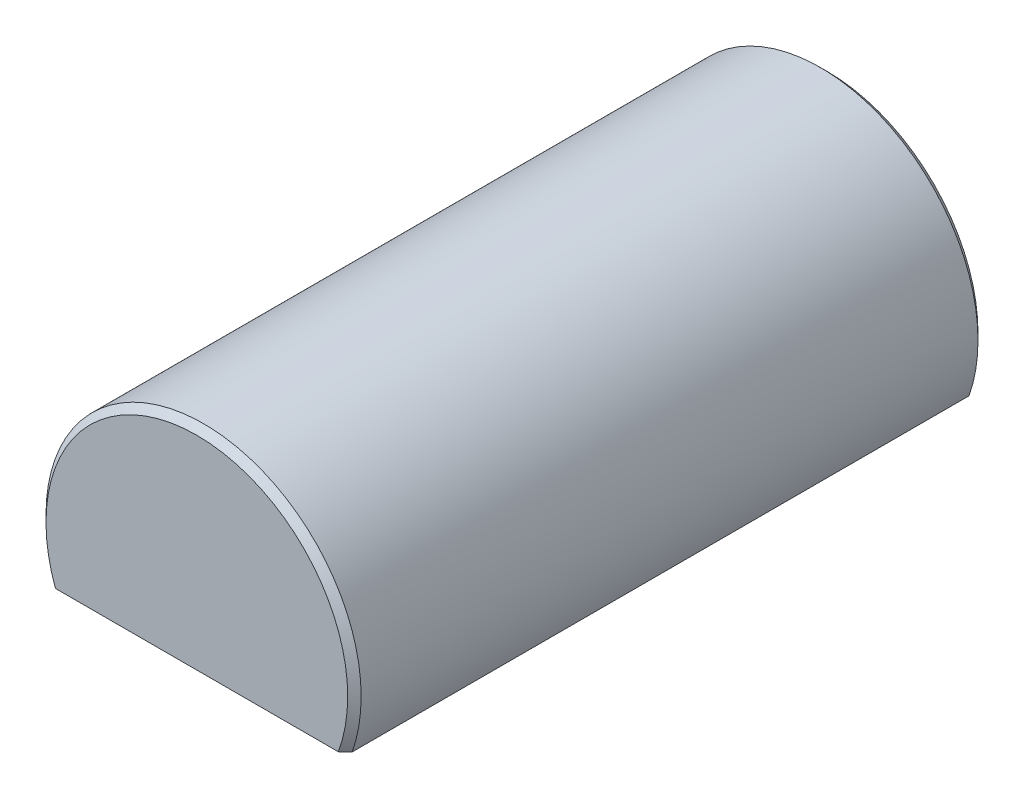
ISO-10303-21;
HEADER;
FILE_DESCRIPTION(('STEP AP214'),'2;1');
FILE_NAME('part.step','',(''),(''),'','','');
FILE_SCHEMA(('AUTOMOTIVE_DESIGN { 1 0 10303 214 1 1 1 1 }'));
ENDSEC;
DATA;
#1=APPLICATION_CONTEXT('core data for automotive mechanical design processes');
#2=APPLICATION_PROTOCOL_DEFINITION('international standard','automotive_design',2000,#1);
#3=PRODUCT_CONTEXT('',#1,'mechanical');
#4=PRODUCT('Part','Part','',(#3));
#5=PRODUCT_RELATED_PRODUCT_CATEGORY('part','',(#4));
#6=PRODUCT_DEFINITION_FORMATION('','',#4);
#7=PRODUCT_DEFINITION_CONTEXT('part definition',#1,'design');
#8=PRODUCT_DEFINITION('design','',#6,#7);
#9=PRODUCT_DEFINITION_SHAPE('','',#8);
#10=(LENGTH_UNIT() NAMED_UNIT(*) SI_UNIT(.MILLI.,.METRE.));
#11=(NAMED_UNIT(*) PLANE_ANGLE_UNIT() SI_UNIT($,.RADIAN.));
#12=(NAMED_UNIT(*) SI_UNIT($,.STERADIAN.) SOLID_ANGLE_UNIT());
#13=UNCERTAINTY_MEASURE_WITH_UNIT(LENGTH_MEASURE(1.E-05),#10,'distance_accuracy_value','');
#14=(GEOMETRIC_REPRESENTATION_CONTEXT(3) GLOBAL_UNCERTAINTY_ASSIGNED_CONTEXT((#13)) GLOBAL_UNIT_ASSIGNED_CONTEXT((#10,
#11,#12)) REPRESENTATION_CONTEXT('',''));
#15=CARTESIAN_POINT('',(0.,0.,0.));
#16=DIRECTION('',(0.,0.,1.));
#17=DIRECTION('',(1.,0.,0.));
#18=AXIS2_PLACEMENT_3D('',#15,#16,#17);
#19=CARTESIAN_POINT('',(0.,0.,19.05));
#20=DIRECTION('',(0.,0.,-1.));
#21=DIRECTION('',(-1.,0.,0.));
#22=AXIS2_PLACEMENT_3D('',#19,#20,#21);
#23=CYLINDRICAL_SURFACE('',#22,9.525);
#24=CARTESIAN_POINT('',(0.,0.,18.6436));
#25=DIRECTION('',(0.,0.,1.));
#26=DIRECTION('',(1.,0.,0.));
#27=AXIS2_PLACEMENT_3D('',#24,#25,#26);
#28=CIRCLE('',#27,9.525);
#29=CARTESIAN_POINT('',(-8.98025612106915,-3.175,18.6436));
#30=VERTEX_POINT('',#29);
#31=CARTESIAN_POINT('',(8.98025612106915,-3.175,18.6436));
#32=VERTEX_POINT('',#31);
#33=EDGE_CURVE('E223',#30,#32,#28,.F.);
#34=ORIENTED_EDGE('',*,*,#33,.T.);
#35=DIRECTION('',(0.,0.,1.));
#36=VECTOR('',#35,1.);
#37=CARTESIAN_POINT('',(8.98025612106915,-3.175,-19.05));
#38=LINE('',#37,#36);
#39=CARTESIAN_POINT('',(8.98025612106915,-3.175,-18.6436));
#40=VERTEX_POINT('',#39);
#41=EDGE_CURVE('E210',#40,#32,#38,.T.);
#42=ORIENTED_EDGE('',*,*,#41,.F.);
#43=CARTESIAN_POINT('',(0.,0.,-18.6436));
#44=DIRECTION('',(0.,0.,1.));
#45=DIRECTION('',(1.,0.,0.));
#46=AXIS2_PLACEMENT_3D('',#43,#44,#45);
#47=CIRCLE('',#46,9.525);
#48=CARTESIAN_POINT('',(-8.98025612106915,-3.175,-18.6436));
#49=VERTEX_POINT('',#48);
#50=EDGE_CURVE('E307',#40,#49,#47,.T.);
#51=ORIENTED_EDGE('',*,*,#50,.T.);
#52=DIRECTION('',(0.,0.,1.));
#53=VECTOR('',#52,1.);
#54=CARTESIAN_POINT('',(-8.98025612106915,-3.175,-19.05));
#55=LINE('',#54,#53);
#56=EDGE_CURVE('E211',#49,#30,#55,.T.);
#57=ORIENTED_EDGE('',*,*,#56,.T.);
#58=EDGE_LOOP('',(#34,#42,#51,#57));
#59=FACE_BOUND('',#58,.T.);
#60=ADVANCED_FACE('F46',(#59),#23,.T.);
#61=CARTESIAN_POINT('',(0.,0.,19.05));
#62=DIRECTION('',(0.,0.,1.));
#63=DIRECTION('',(1.,0.,0.));
#64=AXIS2_PLACEMENT_3D('',#61,#62,#63);
#65=PLANE('',#64);
#66=DIRECTION('',(-1.,0.,0.));
#67=VECTOR('',#66,1.);
#68=CARTESIAN_POINT('',(-8.98025612106915,-3.175,19.05));
#69=LINE('',#68,#67);
#70=CARTESIAN_POINT('',(8.54799631258697,-3.175,19.05));
#71=VERTEX_POINT('',#70);
#72=CARTESIAN_POINT('',(-8.54799631258697,-3.175,19.05));
#73=VERTEX_POINT('',#72);
#74=EDGE_CURVE('E68',#71,#73,#69,.T.);
#75=ORIENTED_EDGE('',*,*,#74,.F.);
#76=CARTESIAN_POINT('',(0.,0.,19.05));
#77=DIRECTION('',(0.,0.,1.));
#78=DIRECTION('',(1.,0.,0.));
#79=AXIS2_PLACEMENT_3D('',#76,#77,#78);
#80=CIRCLE('',#79,9.11860000000002);
#81=EDGE_CURVE('E245',#71,#73,#80,.T.);
#82=ORIENTED_EDGE('',*,*,#81,.T.);
#83=EDGE_LOOP('',(#75,#82));
#84=FACE_BOUND('',#83,.T.);
#85=ADVANCED_FACE('F293',(#84),#65,.T.);
#86=CARTESIAN_POINT('',(0.,0.,-19.05));
#87=DIRECTION('',(0.,0.,1.));
#88=DIRECTION('',(1.,0.,0.));
#89=AXIS2_PLACEMENT_3D('',#86,#87,#88);
#90=PLANE('',#89);
#91=CARTESIAN_POINT('',(0.,0.,-19.05));
#92=DIRECTION('',(0.,0.,1.));
#93=DIRECTION('',(1.,0.,0.));
#94=AXIS2_PLACEMENT_3D('',#91,#92,#93);
#95=CIRCLE('',#94,9.11859999999996);
#96=CARTESIAN_POINT('',(-8.54799631258691,-3.175,-19.05));
#97=VERTEX_POINT('',#96);
#98=CARTESIAN_POINT('',(8.54799631258691,-3.175,-19.05));
#99=VERTEX_POINT('',#98);
#100=EDGE_CURVE('E308',#97,#99,#95,.F.);
#101=ORIENTED_EDGE('',*,*,#100,.T.);
#102=DIRECTION('',(-1.,0.,0.));
#103=VECTOR('',#102,1.);
#104=CARTESIAN_POINT('',(-8.98025612106915,-3.175,-19.05));
#105=LINE('',#104,#103);
#106=EDGE_CURVE('E207',#99,#97,#105,.T.);
#107=ORIENTED_EDGE('',*,*,#106,.T.);
#108=EDGE_LOOP('',(#101,#107));
#109=FACE_BOUND('',#108,.T.);
#110=ADVANCED_FACE('F298',(#109),#90,.F.);
#111=CARTESIAN_POINT('',(0.,0.,-18.6436));
#112=DIRECTION('',(0.,0.,1.));
#113=DIRECTION('',(1.,0.,0.));
#114=AXIS2_PLACEMENT_3D('',#111,#112,#113);
#115=CONICAL_SURFACE('',#114,9.525,0.785398163397444);
#116=CARTESIAN_POINT('',(-19.7595218480049,-3.175,-8.15562099481972));
#117=CARTESIAN_POINT('',(-19.1925140216925,-3.175,-8.71541833970159));
#118=CARTESIAN_POINT('',(-18.6252305331766,-3.175,-9.2749372301075));
#119=CARTESIAN_POINT('',(-17.4894657452954,-3.175,-10.3935596725078));
#120=CARTESIAN_POINT('',(-16.9209838832793,-3.175,-10.9526626531449));
#121=CARTESIAN_POINT('',(-15.7755741167121,-3.175,-12.0770696474654));
#122=CARTESIAN_POINT('',(-15.1986325304486,-3.175,-12.6423597290652));
#123=CARTESIAN_POINT('',(-14.0436688072204,-3.175,-13.7710255464828));
#124=CARTESIAN_POINT('',(-13.4656477108255,-3.175,-14.3344023462318));
#125=CARTESIAN_POINT('',(-12.4705159540613,-3.175,-15.3006344002602));
#126=CARTESIAN_POINT('',(-12.053923381691,-3.175,-15.7040230509635));
#127=CARTESIAN_POINT('',(-11.2192222208861,-3.175,-16.5092923897319));
#128=CARTESIAN_POINT('',(-10.801113522204,-3.175,-16.9111729636285));
#129=CARTESIAN_POINT('',(-9.96180438900596,-3.175,-17.7137894720875));
#130=CARTESIAN_POINT('',(-9.54059885127731,-3.175,-18.1145200738019));
#131=CARTESIAN_POINT('',(-8.69536369274989,-3.175,-18.9127645983045));
#132=CARTESIAN_POINT('',(-8.27133489125377,-3.175,-19.3102793859794));
#133=CARTESIAN_POINT('',(-7.63417072982144,-3.175,-19.9008908184188));
#134=CARTESIAN_POINT('',(-7.42271751985768,-3.175,-20.0958012630927));
#135=CARTESIAN_POINT('',(-6.99843064471583,-3.175,-20.484114250534));
#136=CARTESIAN_POINT('',(-6.78559698276185,-3.175,-20.6775167968208));
#137=CARTESIAN_POINT('',(-6.35793966377379,-3.175,-21.0625925503336));
#138=CARTESIAN_POINT('',(-6.1431140635317,-3.175,-21.254263604613));
#139=CARTESIAN_POINT('',(-5.81916935713244,-3.175,-21.5398164840543));
#140=CARTESIAN_POINT('',(-5.71090790489853,-3.175,-21.63467128779));
#141=CARTESIAN_POINT('',(-5.49371873101143,-3.175,-21.8236251078582));
#142=CARTESIAN_POINT('',(-5.38479097918381,-3.175,-21.9177240895089));
#143=CARTESIAN_POINT('',(-5.05787462655518,-3.175,-22.197831488485));
#144=CARTESIAN_POINT('',(-4.83875951405758,-3.175,-22.3825297757046));
#145=CARTESIAN_POINT('',(-4.39646847568306,-3.175,-22.7469971377807));
#146=CARTESIAN_POINT('',(-4.17329291837066,-3.175,-22.9267666563421));
#147=CARTESIAN_POINT('',(-3.834437030073,-3.175,-23.1907907398475));
#148=CARTESIAN_POINT('',(-3.72089777113939,-3.175,-23.2777913468337));
#149=CARTESIAN_POINT('',(-3.49211368943674,-3.175,-23.4495161287082));
#150=CARTESIAN_POINT('',(-3.37686895479634,-3.175,-23.5342404205902));
#151=CARTESIAN_POINT('',(-3.14439364175474,-3.175,-23.7007968775851));
#152=CARTESIAN_POINT('',(-3.02716412294898,-3.175,-23.7826305180934));
#153=CARTESIAN_POINT('',(-2.79025811492876,-3.175,-23.9426648438419));
#154=CARTESIAN_POINT('',(-2.67058203505147,-3.175,-24.0208661297667));
#155=CARTESIAN_POINT('',(-2.52052463750115,-3.175,-24.1148160231544));
#156=CARTESIAN_POINT('',(-2.49152725675283,-3.175,-24.1327846392309));
#157=CARTESIAN_POINT('',(-2.43335482916832,-3.175,-24.1684360452421));
#158=CARTESIAN_POINT('',(-2.40417977182546,-3.175,-24.1861188180433));
#159=CARTESIAN_POINT('',(-2.31637282554542,-3.175,-24.2387132160758));
#160=CARTESIAN_POINT('',(-2.25746552490121,-3.175,-24.2731669271137));
#161=CARTESIAN_POINT('',(-2.1388499163387,-3.175,-24.3406860355773));
#162=CARTESIAN_POINT('',(-2.07914152230359,-3.175,-24.3737512821406));
#163=CARTESIAN_POINT('',(-1.95887197027486,-3.175,-24.4382873931207));
#164=CARTESIAN_POINT('',(-1.89831082667789,-3.175,-24.4697582844134));
#165=CARTESIAN_POINT('',(-1.71626949487598,-3.175,-24.5609395675323));
#166=CARTESIAN_POINT('',(-1.59343488727855,-3.175,-24.6179939551702));
#167=CARTESIAN_POINT('',(-1.34381268045637,-3.175,-24.7227838688996));
#168=CARTESIAN_POINT('',(-1.21702599819507,-3.175,-24.7705215382717));
#169=CARTESIAN_POINT('',(-0.996141655492447,-3.175,-24.8421407238445));
#170=CARTESIAN_POINT('',(-0.902996312538601,-3.175,-24.8689462359184));
#171=CARTESIAN_POINT('',(-0.714930875138811,-3.175,-24.9153774201317));
#172=CARTESIAN_POINT('',(-0.620011232133145,-3.175,-24.9350048931527));
#173=CARTESIAN_POINT('',(-0.429113820304782,-3.175,-24.9661121942424));
#174=CARTESIAN_POINT('',(-0.333139985715256,-3.175,-24.977615821125));
#175=CARTESIAN_POINT('',(-0.140535175388035,-3.175,-24.9919419026325));
#176=CARTESIAN_POINT('',(-0.0439041966456478,-3.175,-24.9947643175371));
#177=CARTESIAN_POINT('',(0.149406571525482,-3.175,-24.9915593092298));
#178=CARTESIAN_POINT('',(0.246086055980357,-3.175,-24.9855137589473));
#179=CARTESIAN_POINT('',(0.438519900949506,-3.175,-24.9648885054497));
#180=CARTESIAN_POINT('',(0.534274210441915,-3.175,-24.9503083342644));
#181=CARTESIAN_POINT('',(0.724543171122349,-3.175,-24.9133206989412));
#182=CARTESIAN_POINT('',(0.819053137345909,-3.175,-24.8908894409841));
#183=CARTESIAN_POINT('',(1.00615993219385,-3.175,-24.8392005441937));
#184=CARTESIAN_POINT('',(1.0987566521195,-3.175,-24.8099425186606));
#185=CARTESIAN_POINT('',(1.39914147587956,-3.175,-24.7045133797523));
#186=CARTESIAN_POINT('',(1.60270242306785,-3.175,-24.6162210584715));
#187=CARTESIAN_POINT('',(1.90064382775073,-3.175,-24.4691905488746));
#188=CARTESIAN_POINT('',(1.99883579493968,-3.175,-24.4176789268811));
#189=CARTESIAN_POINT('',(2.19303970560462,-3.175,-24.310689348493));
#190=CARTESIAN_POINT('',(2.28905201231676,-3.175,-24.2552120594577));
#191=CARTESIAN_POINT('',(2.4798953128031,-3.175,-24.1406178908477));
#192=CARTESIAN_POINT('',(2.57471092780798,-3.175,-24.0814756653363));
#193=CARTESIAN_POINT('',(2.76264452192865,-3.175,-23.9605532577096));
#194=CARTESIAN_POINT('',(2.85576245952455,-3.175,-23.8987730111995));
#195=CARTESIAN_POINT('',(3.04042937935515,-3.175,-23.7731180965308));
#196=CARTESIAN_POINT('',(3.13197987484903,-3.175,-23.7092456447565));
#197=CARTESIAN_POINT('',(3.31380176333075,-3.175,-23.5797169068744));
#198=CARTESIAN_POINT('',(3.40407320172094,-3.175,-23.5140606843272));
#199=CARTESIAN_POINT('',(3.69141418520661,-3.175,-23.3014229643415));
#200=CARTESIAN_POINT('',(3.88637292900485,-3.175,-23.151588840181));
#201=CARTESIAN_POINT('',(4.27238325952007,-3.175,-22.8469554180238));
#202=CARTESIAN_POINT('',(4.46343425596441,-3.175,-22.6921553788549));
#203=CARTESIAN_POINT('',(4.8426569004591,-3.175,-22.3789080776492));
#204=CARTESIAN_POINT('',(5.03082724140774,-3.175,-22.2204592371161));
#205=CARTESIAN_POINT('',(5.40489471047096,-3.175,-21.9008988903215));
#206=CARTESIAN_POINT('',(5.59079177946467,-3.175,-21.7397873150654));
#207=CARTESIAN_POINT('',(5.96110602166873,-3.175,-21.4152716298885));
#208=CARTESIAN_POINT('',(6.14552029598216,-3.175,-21.251864217334));
#209=CARTESIAN_POINT('',(6.51292767139648,-3.175,-20.923457201654));
#210=CARTESIAN_POINT('',(6.69592075452849,-3.175,-20.7584575784562));
#211=CARTESIAN_POINT('',(7.24309250324783,-3.175,-20.261673690703));
#212=CARTESIAN_POINT('',(7.60556693203492,-3.175,-19.9280132070991));
#213=CARTESIAN_POINT('',(8.32608488808928,-3.175,-19.2586757710046));
#214=CARTESIAN_POINT('',(8.68413999682751,-3.175,-18.9230112401011));
#215=CARTESIAN_POINT('',(9.3981109686738,-3.175,-18.2493694292492));
#216=CARTESIAN_POINT('',(9.75402668851613,-3.175,-17.9113919975865));
#217=CARTESIAN_POINT('',(10.4639630698516,-3.175,-17.2340735330514));
#218=CARTESIAN_POINT('',(10.8179851146935,-3.175,-16.8947339485173));
#219=CARTESIAN_POINT('',(11.5248325294695,-3.175,-16.2148101155024));
#220=CARTESIAN_POINT('',(11.877657897126,-3.175,-15.8742258646551));
#221=CARTESIAN_POINT('',(12.8608487771361,-3.175,-14.9225911287922));
#222=CARTESIAN_POINT('',(13.4902037219096,-3.175,-14.3104968974129));
#223=CARTESIAN_POINT('',(14.7471510999705,-3.175,-13.0841616232172));
#224=CARTESIAN_POINT('',(15.3747430059353,-3.175,-12.4699200405842));
#225=CARTESIAN_POINT('',(16.6291765559097,-3.175,-11.2394794340117));
#226=CARTESIAN_POINT('',(17.2560169180586,-3.175,-10.623279103755));
#227=CARTESIAN_POINT('',(18.5085205845556,-3.175,-9.39003560907936));
#228=CARTESIAN_POINT('',(19.1341841706569,-3.175,-8.77299273086808));
#229=CARTESIAN_POINT('',(19.7595218480049,-3.175,-8.15562099481972));
#230=B_SPLINE_CURVE_WITH_KNOTS('',3,(#116,#117,#118,#119,#120,#121,#122,#123,#124,#125,#126,
#127,#128,#129,#130,#131,#132,#133,#134,#135,#136,#137,#138,#139,#140,#141,#142,#143,#144,#145,
#146,#147,#148,#149,#150,#151,#152,#153,#154,#155,#156,#157,#158,#159,#160,#161,#162,#163,#164,
#165,#166,#167,#168,#169,#170,#171,#172,#173,#174,#175,#176,#177,#178,#179,#180,#181,#182,#183,
#184,#185,#186,#187,#188,#189,#190,#191,#192,#193,#194,#195,#196,#197,#198,#199,#200,#201,#202,
#203,#204,#205,#206,#207,#208,#209,#210,#211,#212,#213,#214,#215,#216,#217,#218,#219,#220,#221,
#222,#223,#224,#225,#226,#227,#228,#229),.UNSPECIFIED.,.F.,.F.,(4,2,2,2,2,2,2,2,2,2,2,2,2,2,2,2,
2,2,2,2,2,2,2,2,2,2,2,2,2,2,2,2,2,2,2,2,2,2,2,2,2,2,2,2,2,2,2,2,2,2,2,2,2,2,2,2,4),(0.,
2.39036439291235,4.78241488355238,7.20557841157202,9.62704382276182,11.3667095083409,
13.1065043401574,14.8506262801503,16.594262410402,17.4569983331601,18.3197322416801,
19.1834218216942,19.61523098944,20.0470598592951,20.9067378044763,21.7663381026297,
22.1954349501858,22.6245097015056,23.0533621909907,23.48214350654,23.5844822858614,
23.6868271767687,23.8915394907818,24.096273990368,24.3010050376334,24.7070199187601,
25.1129412871096,25.4034789534971,25.6939436774803,25.9835539148037,26.2731654772176,
26.5633698622611,26.8535901612796,27.144697740264,27.4358218129422,28.0994930845436,
28.4321147937085,28.7646806590594,29.0998804786146,29.4350884851404,29.7699521950312,
30.1048039884221,30.8423225325695,31.5799516696314,32.3179061382374,33.0558797581445,
33.7950537117308,34.5342369959246,36.0121902906525,37.4845465530704,38.9570003383383,
40.4281684211872,41.899339302724,44.5330975472243,47.1675738718103,49.8045566225282,
52.4407967951232),.UNSPECIFIED.);
#231=EDGE_CURVE('E222',#49,#97,#230,.T.);
#232=ORIENTED_EDGE('',*,*,#231,.F.);
#233=ORIENTED_EDGE('',*,*,#50,.F.);
#234=EDGE_CURVE('E214',#99,#40,#230,.T.);
#235=ORIENTED_EDGE('',*,*,#234,.F.);
#236=ORIENTED_EDGE('',*,*,#100,.F.);
#237=EDGE_LOOP('',(#232,#233,#235,#236));
#238=FACE_BOUND('',#237,.T.);
#239=ADVANCED_FACE('F225',(#238),#115,.T.);
#240=CARTESIAN_POINT('',(0.,0.,19.05));
#241=DIRECTION('',(0.,0.,-1.));
#242=DIRECTION('',(-1.,0.,0.));
#243=AXIS2_PLACEMENT_3D('',#240,#241,#242);
#244=CONICAL_SURFACE('',#243,9.11860000000002,0.785398163397444);
#245=CARTESIAN_POINT('',(19.7595218480049,-3.175,8.15562099481978));
#246=CARTESIAN_POINT('',(19.1925140216925,-3.175,8.71541833970165));
#247=CARTESIAN_POINT('',(18.6252305331766,-3.175,9.27493723010756));
#248=CARTESIAN_POINT('',(17.4894657452954,-3.175,10.3935596725079));
#249=CARTESIAN_POINT('',(16.9209838832793,-3.175,10.9526626531449));
#250=CARTESIAN_POINT('',(15.7755741167121,-3.175,12.0770696474655));
#251=CARTESIAN_POINT('',(15.1986325304486,-3.175,12.6423597290653));
#252=CARTESIAN_POINT('',(14.0436688072205,-3.175,13.7710255464829));
#253=CARTESIAN_POINT('',(13.4656477108256,-3.175,14.3344023462319));
#254=CARTESIAN_POINT('',(12.4705159540613,-3.175,15.3006344002603));
#255=CARTESIAN_POINT('',(12.053923381691,-3.175,15.7040230509635));
#256=CARTESIAN_POINT('',(11.2192222208861,-3.175,16.5092923897319));
#257=CARTESIAN_POINT('',(10.801113522204,-3.175,16.9111729636285));
#258=CARTESIAN_POINT('',(9.96180438900597,-3.175,17.7137894720876));
#259=CARTESIAN_POINT('',(9.54059885127732,-3.175,18.1145200738019));
#260=CARTESIAN_POINT('',(8.6953636927499,-3.175,18.9127645983045));
#261=CARTESIAN_POINT('',(8.27133489125378,-3.175,19.3102793859794));
#262=CARTESIAN_POINT('',(7.63417072982144,-3.175,19.9008908184189));
#263=CARTESIAN_POINT('',(7.42271751985768,-3.175,20.0958012630927));
#264=CARTESIAN_POINT('',(6.99843064471583,-3.175,20.484114250534));
#265=CARTESIAN_POINT('',(6.78559698276185,-3.175,20.6775167968209));
#266=CARTESIAN_POINT('',(6.3579396637738,-3.175,21.0625925503337));
#267=CARTESIAN_POINT('',(6.1431140635317,-3.175,21.254263604613));
#268=CARTESIAN_POINT('',(5.81916935713244,-3.175,21.5398164840543));
#269=CARTESIAN_POINT('',(5.71090790489854,-3.175,21.6346712877901));
#270=CARTESIAN_POINT('',(5.49371873101143,-3.175,21.8236251078583));
#271=CARTESIAN_POINT('',(5.38479097918381,-3.175,21.917724089509));
#272=CARTESIAN_POINT('',(5.05787462655518,-3.175,22.1978314884851));
#273=CARTESIAN_POINT('',(4.83875951405758,-3.175,22.3825297757047));
#274=CARTESIAN_POINT('',(4.39646847568306,-3.175,22.7469971377808));
#275=CARTESIAN_POINT('',(4.17329291837066,-3.175,22.9267666563422));
#276=CARTESIAN_POINT('',(3.834437030073,-3.175,23.1907907398475));
#277=CARTESIAN_POINT('',(3.7208977711394,-3.175,23.2777913468337));
#278=CARTESIAN_POINT('',(3.49211368943674,-3.175,23.4495161287083));
#279=CARTESIAN_POINT('',(3.37686895479635,-3.175,23.5342404205903));
#280=CARTESIAN_POINT('',(3.14439364175474,-3.175,23.7007968775851));
#281=CARTESIAN_POINT('',(3.02716412294899,-3.175,23.7826305180934));
#282=CARTESIAN_POINT('',(2.79025811492877,-3.175,23.942664843842));
#283=CARTESIAN_POINT('',(2.67058203505148,-3.175,24.0208661297668));
#284=CARTESIAN_POINT('',(2.52052463750116,-3.175,24.1148160231545));
#285=CARTESIAN_POINT('',(2.49152725675284,-3.175,24.132784639231));
#286=CARTESIAN_POINT('',(2.43335482916832,-3.175,24.1684360452421));
#287=CARTESIAN_POINT('',(2.40417977182547,-3.175,24.1861188180434));
#288=CARTESIAN_POINT('',(2.31637282554543,-3.175,24.2387132160758));
#289=CARTESIAN_POINT('',(2.25746552490122,-3.175,24.2731669271138));
#290=CARTESIAN_POINT('',(2.13884991633871,-3.175,24.3406860355774));
#291=CARTESIAN_POINT('',(2.0791415223036,-3.175,24.3737512821406));
#292=CARTESIAN_POINT('',(1.95887197027487,-3.175,24.4382873931208));
#293=CARTESIAN_POINT('',(1.8983108266779,-3.175,24.4697582844135));
#294=CARTESIAN_POINT('',(1.71626949487598,-3.175,24.5609395675323));
#295=CARTESIAN_POINT('',(1.59343488727856,-3.175,24.6179939551702));
#296=CARTESIAN_POINT('',(1.34381268045638,-3.175,24.7227838688997));
#297=CARTESIAN_POINT('',(1.21702599819507,-3.175,24.7705215382718));
#298=CARTESIAN_POINT('',(0.996141655492448,-3.175,24.8421407238446));
#299=CARTESIAN_POINT('',(0.902996312538599,-3.175,24.8689462359184));
#300=CARTESIAN_POINT('',(0.714930875138808,-3.175,24.9153774201318));
#301=CARTESIAN_POINT('',(0.620011232133142,-3.175,24.9350048931528));
#302=CARTESIAN_POINT('',(0.429113820304779,-3.175,24.9661121942425));
#303=CARTESIAN_POINT('',(0.333139985715255,-3.175,24.9776158211251));
#304=CARTESIAN_POINT('',(0.140535175388034,-3.175,24.9919419026326));
#305=CARTESIAN_POINT('',(0.0439041966456463,-3.175,24.9947643175371));
#306=CARTESIAN_POINT('',(-0.149406571525484,-3.175,24.9915593092299));
#307=CARTESIAN_POINT('',(-0.246086055980359,-3.175,24.9855137589474));
#308=CARTESIAN_POINT('',(-0.438519900949507,-3.175,24.9648885054498));
#309=CARTESIAN_POINT('',(-0.534274210441916,-3.175,24.9503083342645));
#310=CARTESIAN_POINT('',(-0.72454317112235,-3.175,24.9133206989413));
#311=CARTESIAN_POINT('',(-0.819053137345911,-3.175,24.8908894409842));
#312=CARTESIAN_POINT('',(-1.00615993219385,-3.175,24.8392005441938));
#313=CARTESIAN_POINT('',(-1.0987566521195,-3.175,24.8099425186606));
#314=CARTESIAN_POINT('',(-1.39914147587956,-3.175,24.7045133797524));
#315=CARTESIAN_POINT('',(-1.60270242306786,-3.175,24.6162210584716));
#316=CARTESIAN_POINT('',(-1.90064382775074,-3.175,24.4691905488746));
#317=CARTESIAN_POINT('',(-1.99883579493969,-3.175,24.4176789268812));
#318=CARTESIAN_POINT('',(-2.19303970560463,-3.175,24.3106893484931));
#319=CARTESIAN_POINT('',(-2.28905201231677,-3.175,24.2552120594577));
#320=CARTESIAN_POINT('',(-2.4798953128031,-3.175,24.1406178908477));
#321=CARTESIAN_POINT('',(-2.57471092780799,-3.175,24.0814756653364));
#322=CARTESIAN_POINT('',(-2.76264452192865,-3.175,23.9605532577096));
#323=CARTESIAN_POINT('',(-2.85576245952456,-3.175,23.8987730111996));
#324=CARTESIAN_POINT('',(-3.04042937935515,-3.175,23.7731180965309));
#325=CARTESIAN_POINT('',(-3.13197987484903,-3.175,23.7092456447566));
#326=CARTESIAN_POINT('',(-3.31380176333075,-3.175,23.5797169068745));
#327=CARTESIAN_POINT('',(-3.40407320172095,-3.175,23.5140606843273));
#328=CARTESIAN_POINT('',(-3.69141418520661,-3.175,23.3014229643416));
#329=CARTESIAN_POINT('',(-3.88637292900485,-3.175,23.1515888401811));
#330=CARTESIAN_POINT('',(-4.27238325952008,-3.175,22.8469554180239));
#331=CARTESIAN_POINT('',(-4.46343425596441,-3.175,22.692155378855));
#332=CARTESIAN_POINT('',(-4.8426569004591,-3.175,22.3789080776492));
#333=CARTESIAN_POINT('',(-5.03082724140775,-3.175,22.2204592371162));
#334=CARTESIAN_POINT('',(-5.40489471047097,-3.175,21.9008988903215));
#335=CARTESIAN_POINT('',(-5.59079177946468,-3.175,21.7397873150655));
#336=CARTESIAN_POINT('',(-5.96110602166874,-3.175,21.4152716298885));
#337=CARTESIAN_POINT('',(-6.14552029598217,-3.175,21.2518642173341));
#338=CARTESIAN_POINT('',(-6.51292767139649,-3.175,20.923457201654));
#339=CARTESIAN_POINT('',(-6.6959207545285,-3.175,20.7584575784563));
#340=CARTESIAN_POINT('',(-7.24309250324785,-3.175,20.2616736907031));
#341=CARTESIAN_POINT('',(-7.60556693203494,-3.175,19.9280132070991));
#342=CARTESIAN_POINT('',(-8.3260848880893,-3.175,19.2586757710046));
#343=CARTESIAN_POINT('',(-8.68413999682752,-3.175,18.9230112401011));
#344=CARTESIAN_POINT('',(-9.39811096867382,-3.175,18.2493694292493));
#345=CARTESIAN_POINT('',(-9.75402668851615,-3.175,17.9113919975865));
#346=CARTESIAN_POINT('',(-10.4639630698516,-3.175,17.2340735330514));
#347=CARTESIAN_POINT('',(-10.8179851146935,-3.175,16.8947339485173));
#348=CARTESIAN_POINT('',(-11.5248325294696,-3.175,16.2148101155025));
#349=CARTESIAN_POINT('',(-11.877657897126,-3.175,15.8742258646551));
#350=CARTESIAN_POINT('',(-12.8608487771361,-3.175,14.9225911287922));
#351=CARTESIAN_POINT('',(-13.4902037219097,-3.175,14.3104968974129));
#352=CARTESIAN_POINT('',(-14.7471510999705,-3.175,13.0841616232173));
#353=CARTESIAN_POINT('',(-15.3747430059353,-3.175,12.4699200405843));
#354=CARTESIAN_POINT('',(-16.6291765559097,-3.175,11.2394794340118));
#355=CARTESIAN_POINT('',(-17.2560169180586,-3.175,10.623279103755));
#356=CARTESIAN_POINT('',(-18.5085205845556,-3.175,9.39003560907942));
#357=CARTESIAN_POINT('',(-19.1341841706569,-3.175,8.77299273086814));
#358=CARTESIAN_POINT('',(-19.7595218480049,-3.175,8.15562099481978));
#359=B_SPLINE_CURVE_WITH_KNOTS('',3,(#245,#246,#247,#248,#249,#250,#251,#252,#253,#254,#255,
#256,#257,#258,#259,#260,#261,#262,#263,#264,#265,#266,#267,#268,#269,#270,#271,#272,#273,#274,
#275,#276,#277,#278,#279,#280,#281,#282,#283,#284,#285,#286,#287,#288,#289,#290,#291,#292,#293,
#294,#295,#296,#297,#298,#299,#300,#301,#302,#303,#304,#305,#306,#307,#308,#309,#310,#311,#312,
#313,#314,#315,#316,#317,#318,#319,#320,#321,#322,#323,#324,#325,#326,#327,#328,#329,#330,#331,
#332,#333,#334,#335,#336,#337,#338,#339,#340,#341,#342,#343,#344,#345,#346,#347,#348,#349,#350,
#351,#352,#353,#354,#355,#356,#357,#358),.UNSPECIFIED.,.F.,.F.,(4,2,2,2,2,2,2,2,2,2,2,2,2,2,2,2,
2,2,2,2,2,2,2,2,2,2,2,2,2,2,2,2,2,2,2,2,2,2,2,2,2,2,2,2,2,2,2,2,2,2,2,2,2,2,2,2,4),(0.,
2.39036439291235,4.78241488355238,7.20557841157201,9.62704382276182,11.3667095083409,
13.1065043401574,14.8506262801503,16.594262410402,17.4569983331601,18.3197322416801,
19.1834218216942,19.61523098944,20.0470598592951,20.9067378044763,21.7663381026297,
22.1954349501858,22.6245097015056,23.0533621909907,23.48214350654,23.5844822858614,
23.6868271767687,23.8915394907818,24.096273990368,24.3010050376334,24.7070199187601,
25.1129412871096,25.4034789534971,25.6939436774803,25.9835539148037,26.2731654772176,
26.5633698622612,26.8535901612796,27.144697740264,27.4358218129422,28.0994930845437,
28.4321147937085,28.7646806590594,29.0998804786146,29.4350884851404,29.7699521950312,
30.1048039884221,30.8423225325695,31.5799516696314,32.3179061382375,33.0558797581445,
33.7950537117308,34.5342369959246,36.0121902906525,37.4845465530705,38.9570003383384,
40.4281684211872,41.8993393027241,44.5330975472244,47.1675738718103,49.8045566225282,
52.4407967951232),.UNSPECIFIED.);
#360=EDGE_CURVE('E244',#32,#71,#359,.T.);
#361=ORIENTED_EDGE('',*,*,#360,.F.);
#362=ORIENTED_EDGE('',*,*,#33,.F.);
#363=EDGE_CURVE('E238',#73,#30,#359,.T.);
#364=ORIENTED_EDGE('',*,*,#363,.F.);
#365=ORIENTED_EDGE('',*,*,#81,.F.);
#366=EDGE_LOOP('',(#361,#362,#364,#365));
#367=FACE_BOUND('',#366,.T.);
#368=ADVANCED_FACE('F233',(#367),#244,.T.);
#369=CARTESIAN_POINT('',(-8.98025612106915,-3.175,-19.05));
#370=DIRECTION('',(0.,1.,0.));
#371=DIRECTION('',(0.,0.,1.));
#372=AXIS2_PLACEMENT_3D('',#369,#370,#371);
#373=PLANE('',#372);
#374=DIRECTION('',(0.,0.,-1.));
#375=VECTOR('',#374,1.);
#376=CARTESIAN_POINT('',(-6.59900612106916,-3.175,16.16075));
#377=LINE('',#376,#375);
#378=CARTESIAN_POINT('',(-6.59900612106916,-3.175,16.16075));
#379=VERTEX_POINT('',#378);
#380=CARTESIAN_POINT('',(-6.59900612106916,-3.175,-16.16075));
#381=VERTEX_POINT('',#380);
#382=EDGE_CURVE('E149',#379,#381,#377,.T.);
#383=ORIENTED_EDGE('',*,*,#382,.F.);
#384=CARTESIAN_POINT('',(-6.09100612106916,-3.175,16.16075));
#385=DIRECTION('',(0.,-1.,0.));
#386=DIRECTION('',(0.,0.,-1.));
#387=AXIS2_PLACEMENT_3D('',#384,#385,#386);
#388=CIRCLE('',#387,0.508000000000002);
#389=CARTESIAN_POINT('',(-6.09100612106916,-3.175,16.66875));
#390=VERTEX_POINT('',#389);
#391=EDGE_CURVE('E60',#390,#379,#388,.T.);
#392=ORIENTED_EDGE('',*,*,#391,.F.);
#393=DIRECTION('',(-1.,0.,0.));
#394=VECTOR('',#393,1.);
#395=CARTESIAN_POINT('',(6.09100612106915,-3.175,16.66875));
#396=LINE('',#395,#394);
#397=CARTESIAN_POINT('',(6.09100612106915,-3.175,16.66875));
#398=VERTEX_POINT('',#397);
#399=EDGE_CURVE('E170',#398,#390,#396,.T.);
#400=ORIENTED_EDGE('',*,*,#399,.F.);
#401=CARTESIAN_POINT('',(6.09100612106915,-3.175,16.16075));
#402=DIRECTION('',(0.,-1.,0.));
#403=DIRECTION('',(0.,0.,1.));
#404=AXIS2_PLACEMENT_3D('',#401,#402,#403);
#405=CIRCLE('',#404,0.508000000000002);
#406=CARTESIAN_POINT('',(6.59900612106916,-3.175,16.16075));
#407=VERTEX_POINT('',#406);
#408=EDGE_CURVE('E167',#407,#398,#405,.T.);
#409=ORIENTED_EDGE('',*,*,#408,.F.);
#410=DIRECTION('',(0.,0.,1.));
#411=VECTOR('',#410,1.);
#412=CARTESIAN_POINT('',(6.59900612106915,-3.175,16.16075));
#413=LINE('',#412,#411);
#414=CARTESIAN_POINT('',(6.59900612106915,-3.175,-16.16075));
#415=VERTEX_POINT('',#414);
#416=EDGE_CURVE('E164',#415,#407,#413,.T.);
#417=ORIENTED_EDGE('',*,*,#416,.F.);
#418=CARTESIAN_POINT('',(6.09100612106915,-3.175,-16.16075));
#419=DIRECTION('',(0.,-1.,0.));
#420=DIRECTION('',(0.,0.,1.));
#421=AXIS2_PLACEMENT_3D('',#418,#419,#420);
#422=CIRCLE('',#421,0.508000000000002);
#423=CARTESIAN_POINT('',(6.09100612106915,-3.175,-16.66875));
#424=VERTEX_POINT('',#423);
#425=EDGE_CURVE('E158',#424,#415,#422,.T.);
#426=ORIENTED_EDGE('',*,*,#425,.F.);
#427=DIRECTION('',(1.,0.,0.));
#428=VECTOR('',#427,1.);
#429=CARTESIAN_POINT('',(6.09100612106915,-3.175,-16.66875));
#430=LINE('',#429,#428);
#431=CARTESIAN_POINT('',(-6.09100612106916,-3.175,-16.66875));
#432=VERTEX_POINT('',#431);
#433=EDGE_CURVE('E156',#432,#424,#430,.T.);
#434=ORIENTED_EDGE('',*,*,#433,.F.);
#435=CARTESIAN_POINT('',(-6.09100612106916,-3.175,-16.16075));
#436=DIRECTION('',(0.,-1.,0.));
#437=DIRECTION('',(0.,0.,1.));
#438=AXIS2_PLACEMENT_3D('',#435,#436,#437);
#439=CIRCLE('',#438,0.508000000000002);
#440=EDGE_CURVE('E138',#381,#432,#439,.T.);
#441=ORIENTED_EDGE('',*,*,#440,.F.);
#442=EDGE_LOOP('',(#383,#392,#400,#409,#417,#426,#434,#441));
#443=FACE_BOUND('',#442,.T.);
#444=ORIENTED_EDGE('',*,*,#231,.T.);
#445=ORIENTED_EDGE('',*,*,#106,.F.);
#446=ORIENTED_EDGE('',*,*,#234,.T.);
#447=ORIENTED_EDGE('',*,*,#41,.T.);
#448=ORIENTED_EDGE('',*,*,#360,.T.);
#449=ORIENTED_EDGE('',*,*,#74,.T.);
#450=ORIENTED_EDGE('',*,*,#363,.T.);
#451=ORIENTED_EDGE('',*,*,#56,.F.);
#452=EDGE_LOOP('',(#444,#445,#446,#447,#448,#449,#450,#451));
#453=FACE_BOUND('',#452,.T.);
#454=ADVANCED_FACE('F153',(#443,#453),#373,.F.);
#455=CARTESIAN_POINT('',(-6.09100612106916,-3.048,16.16075));
#456=DIRECTION('',(0.,-1.,0.));
#457=DIRECTION('',(0.,0.,-1.));
#458=AXIS2_PLACEMENT_3D('',#455,#456,#457);
#459=CYLINDRICAL_SURFACE('',#458,0.508000000000002);
#460=ORIENTED_EDGE('',*,*,#391,.T.);
#461=DIRECTION('',(0.,-1.,0.));
#462=VECTOR('',#461,1.);
#463=CARTESIAN_POINT('',(-6.59900612106916,-3.048,16.16075));
#464=LINE('',#463,#462);
#465=CARTESIAN_POINT('',(-6.59900612106916,-3.048,16.16075));
#466=VERTEX_POINT('',#465);
#467=EDGE_CURVE('E146',#466,#379,#464,.T.);
#468=ORIENTED_EDGE('',*,*,#467,.F.);
#469=CARTESIAN_POINT('',(-6.09100612106916,-3.048,16.16075));
#470=DIRECTION('',(0.,-1.,0.));
#471=DIRECTION('',(0.,0.,-1.));
#472=AXIS2_PLACEMENT_3D('',#469,#470,#471);
#473=CIRCLE('',#472,0.508000000000002);
#474=CARTESIAN_POINT('',(-6.09100612106916,-3.048,16.66875));
#475=VERTEX_POINT('',#474);
#476=EDGE_CURVE('E173',#475,#466,#473,.T.);
#477=ORIENTED_EDGE('',*,*,#476,.F.);
#478=DIRECTION('',(0.,-1.,0.));
#479=VECTOR('',#478,1.);
#480=CARTESIAN_POINT('',(-6.09100612106916,-3.048,16.66875));
#481=LINE('',#480,#479);
#482=EDGE_CURVE('E194',#475,#390,#481,.T.);
#483=ORIENTED_EDGE('',*,*,#482,.T.);
#484=EDGE_LOOP('',(#460,#468,#477,#483));
#485=FACE_BOUND('',#484,.T.);
#486=ADVANCED_FACE('F232',(#485),#459,.F.);
#487=CARTESIAN_POINT('',(6.09100612106915,-3.048,16.66875));
#488=DIRECTION('',(0.,0.,1.));
#489=DIRECTION('',(1.,0.,0.));
#490=AXIS2_PLACEMENT_3D('',#487,#488,#489);
#491=PLANE('',#490);
#492=ORIENTED_EDGE('',*,*,#399,.T.);
#493=ORIENTED_EDGE('',*,*,#482,.F.);
#494=DIRECTION('',(-1.,0.,0.));
#495=VECTOR('',#494,1.);
#496=CARTESIAN_POINT('',(6.09100612106915,-3.048,16.66875));
#497=LINE('',#496,#495);
#498=CARTESIAN_POINT('',(6.09100612106915,-3.048,16.66875));
#499=VERTEX_POINT('',#498);
#500=EDGE_CURVE('E191',#499,#475,#497,.T.);
#501=ORIENTED_EDGE('',*,*,#500,.F.);
#502=DIRECTION('',(0.,-1.,0.));
#503=VECTOR('',#502,1.);
#504=CARTESIAN_POINT('',(6.09100612106915,-3.048,16.66875));
#505=LINE('',#504,#503);
#506=EDGE_CURVE('E196',#499,#398,#505,.T.);
#507=ORIENTED_EDGE('',*,*,#506,.T.);
#508=EDGE_LOOP('',(#492,#493,#501,#507));
#509=FACE_BOUND('',#508,.T.);
#510=ADVANCED_FACE('F359',(#509),#491,.F.);
#511=CARTESIAN_POINT('',(6.09100612106915,-3.048,16.16075));
#512=DIRECTION('',(0.,-1.,0.));
#513=DIRECTION('',(0.,0.,-1.));
#514=AXIS2_PLACEMENT_3D('',#511,#512,#513);
#515=CYLINDRICAL_SURFACE('',#514,0.508000000000002);
#516=ORIENTED_EDGE('',*,*,#408,.T.);
#517=ORIENTED_EDGE('',*,*,#506,.F.);
#518=CARTESIAN_POINT('',(6.09100612106915,-3.048,16.16075));
#519=DIRECTION('',(0.,-1.,0.));
#520=DIRECTION('',(0.,0.,1.));
#521=AXIS2_PLACEMENT_3D('',#518,#519,#520);
#522=CIRCLE('',#521,0.508000000000002);
#523=CARTESIAN_POINT('',(6.59900612106916,-3.048,16.16075));
#524=VERTEX_POINT('',#523);
#525=EDGE_CURVE('E188',#524,#499,#522,.T.);
#526=ORIENTED_EDGE('',*,*,#525,.F.);
#527=DIRECTION('',(0.,-1.,0.));
#528=VECTOR('',#527,1.);
#529=CARTESIAN_POINT('',(6.59900612106916,-3.048,16.16075));
#530=LINE('',#529,#528);
#531=EDGE_CURVE('E198',#524,#407,#530,.T.);
#532=ORIENTED_EDGE('',*,*,#531,.T.);
#533=EDGE_LOOP('',(#516,#517,#526,#532));
#534=FACE_BOUND('',#533,.T.);
#535=ADVANCED_FACE('F366',(#534),#515,.F.);
#536=CARTESIAN_POINT('',(6.59900612106915,-3.048,16.16075));
#537=DIRECTION('',(1.,0.,0.));
#538=DIRECTION('',(0.,0.,-1.));
#539=AXIS2_PLACEMENT_3D('',#536,#537,#538);
#540=PLANE('',#539);
#541=ORIENTED_EDGE('',*,*,#416,.T.);
#542=ORIENTED_EDGE('',*,*,#531,.F.);
#543=DIRECTION('',(0.,0.,1.));
#544=VECTOR('',#543,1.);
#545=CARTESIAN_POINT('',(6.59900612106915,-3.048,16.16075));
#546=LINE('',#545,#544);
#547=CARTESIAN_POINT('',(6.59900612106915,-3.048,-16.16075));
#548=VERTEX_POINT('',#547);
#549=EDGE_CURVE('E185',#548,#524,#546,.T.);
#550=ORIENTED_EDGE('',*,*,#549,.F.);
#551=DIRECTION('',(0.,-1.,0.));
#552=VECTOR('',#551,1.);
#553=CARTESIAN_POINT('',(6.59900612106915,-3.048,-16.16075));
#554=LINE('',#553,#552);
#555=EDGE_CURVE('E200',#548,#415,#554,.T.);
#556=ORIENTED_EDGE('',*,*,#555,.T.);
#557=EDGE_LOOP('',(#541,#542,#550,#556));
#558=FACE_BOUND('',#557,.T.);
#559=ADVANCED_FACE('F375',(#558),#540,.F.);
#560=CARTESIAN_POINT('',(6.09100612106915,-3.048,-16.16075));
#561=DIRECTION('',(0.,-1.,0.));
#562=DIRECTION('',(0.,0.,-1.));
#563=AXIS2_PLACEMENT_3D('',#560,#561,#562);
#564=CYLINDRICAL_SURFACE('',#563,0.508000000000002);
#565=ORIENTED_EDGE('',*,*,#425,.T.);
#566=ORIENTED_EDGE('',*,*,#555,.F.);
#567=CARTESIAN_POINT('',(6.09100612106915,-3.048,-16.16075));
#568=DIRECTION('',(0.,-1.,0.));
#569=DIRECTION('',(0.,0.,1.));
#570=AXIS2_PLACEMENT_3D('',#567,#568,#569);
#571=CIRCLE('',#570,0.508000000000002);
#572=CARTESIAN_POINT('',(6.09100612106915,-3.048,-16.66875));
#573=VERTEX_POINT('',#572);
#574=EDGE_CURVE('E182',#573,#548,#571,.T.);
#575=ORIENTED_EDGE('',*,*,#574,.F.);
#576=DIRECTION('',(0.,-1.,0.));
#577=VECTOR('',#576,1.);
#578=CARTESIAN_POINT('',(6.09100612106915,-3.048,-16.66875));
#579=LINE('',#578,#577);
#580=EDGE_CURVE('E202',#573,#424,#579,.T.);
#581=ORIENTED_EDGE('',*,*,#580,.T.);
#582=EDGE_LOOP('',(#565,#566,#575,#581));
#583=FACE_BOUND('',#582,.T.);
#584=ADVANCED_FACE('F384',(#583),#564,.F.);
#585=CARTESIAN_POINT('',(6.09100612106915,-3.048,-16.66875));
#586=DIRECTION('',(0.,0.,-1.));
#587=DIRECTION('',(-1.,0.,0.));
#588=AXIS2_PLACEMENT_3D('',#585,#586,#587);
#589=PLANE('',#588);
#590=ORIENTED_EDGE('',*,*,#433,.T.);
#591=ORIENTED_EDGE('',*,*,#580,.F.);
#592=DIRECTION('',(1.,0.,0.));
#593=VECTOR('',#592,1.);
#594=CARTESIAN_POINT('',(6.09100612106915,-3.048,-16.66875));
#595=LINE('',#594,#593);
#596=CARTESIAN_POINT('',(-6.09100612106916,-3.048,-16.66875));
#597=VERTEX_POINT('',#596);
#598=EDGE_CURVE('E179',#597,#573,#595,.T.);
#599=ORIENTED_EDGE('',*,*,#598,.F.);
#600=DIRECTION('',(0.,-1.,0.));
#601=VECTOR('',#600,1.);
#602=CARTESIAN_POINT('',(-6.09100612106916,-3.048,-16.66875));
#603=LINE('',#602,#601);
#604=EDGE_CURVE('E145',#597,#432,#603,.T.);
#605=ORIENTED_EDGE('',*,*,#604,.T.);
#606=EDGE_LOOP('',(#590,#591,#599,#605));
#607=FACE_BOUND('',#606,.T.);
#608=ADVANCED_FACE('F393',(#607),#589,.F.);
#609=CARTESIAN_POINT('',(-6.09100612106916,-3.048,-16.16075));
#610=DIRECTION('',(0.,-1.,0.));
#611=DIRECTION('',(0.,0.,-1.));
#612=AXIS2_PLACEMENT_3D('',#609,#610,#611);
#613=CYLINDRICAL_SURFACE('',#612,0.508000000000002);
#614=ORIENTED_EDGE('',*,*,#440,.T.);
#615=ORIENTED_EDGE('',*,*,#604,.F.);
#616=CARTESIAN_POINT('',(-6.09100612106916,-3.048,-16.16075));
#617=DIRECTION('',(0.,-1.,0.));
#618=DIRECTION('',(0.,0.,1.));
#619=AXIS2_PLACEMENT_3D('',#616,#617,#618);
#620=CIRCLE('',#619,0.508000000000002);
#621=CARTESIAN_POINT('',(-6.59900612106916,-3.048,-16.16075));
#622=VERTEX_POINT('',#621);
#623=EDGE_CURVE('E141',#622,#597,#620,.T.);
#624=ORIENTED_EDGE('',*,*,#623,.F.);
#625=DIRECTION('',(0.,-1.,0.));
#626=VECTOR('',#625,1.);
#627=CARTESIAN_POINT('',(-6.59900612106916,-3.048,-16.16075));
#628=LINE('',#627,#626);
#629=EDGE_CURVE('E134',#622,#381,#628,.T.);
#630=ORIENTED_EDGE('',*,*,#629,.T.);
#631=EDGE_LOOP('',(#614,#615,#624,#630));
#632=FACE_BOUND('',#631,.T.);
#633=ADVANCED_FACE('F136',(#632),#613,.F.);
#634=CARTESIAN_POINT('',(-6.59900612106916,-3.048,16.16075));
#635=DIRECTION('',(-1.,0.,0.));
#636=DIRECTION('',(0.,0.,1.));
#637=AXIS2_PLACEMENT_3D('',#634,#635,#636);
#638=PLANE('',#637);
#639=ORIENTED_EDGE('',*,*,#382,.T.);
#640=ORIENTED_EDGE('',*,*,#629,.F.);
#641=DIRECTION('',(0.,0.,-1.));
#642=VECTOR('',#641,1.);
#643=CARTESIAN_POINT('',(-6.59900612106916,-3.048,16.16075));
#644=LINE('',#643,#642);
#645=EDGE_CURVE('E176',#466,#622,#644,.T.);
#646=ORIENTED_EDGE('',*,*,#645,.F.);
#647=ORIENTED_EDGE('',*,*,#467,.T.);
#648=EDGE_LOOP('',(#639,#640,#646,#647));
#649=FACE_BOUND('',#648,.T.);
#650=ADVANCED_FACE('F150',(#649),#638,.F.);
#651=CARTESIAN_POINT('',(-6.09100612106916,-3.048,16.16075));
#652=DIRECTION('',(0.,-1.,0.));
#653=DIRECTION('',(0.,0.,-1.));
#654=AXIS2_PLACEMENT_3D('',#651,#652,#653);
#655=PLANE('',#654);
#656=CARTESIAN_POINT('',(0.,-3.048,-12.7));
#657=DIRECTION('',(0.,-1.,0.));
#658=DIRECTION('',(0.,0.,-1.));
#659=AXIS2_PLACEMENT_3D('',#656,#657,#658);
#660=CIRCLE('',#659,3.17500000000001);
#661=CARTESIAN_POINT('',(0.,-3.048,-15.875));
#662=VERTEX_POINT('',#661);
#663=EDGE_CURVE('E53',#662,#662,#660,.F.);
#664=ORIENTED_EDGE('',*,*,#663,.T.);
#665=EDGE_LOOP('',(#664));
#666=FACE_BOUND('',#665,.T.);
#667=CARTESIAN_POINT('',(0.,-3.048,12.7));
#668=DIRECTION('',(0.,-1.,0.));
#669=DIRECTION('',(0.,0.,-1.));
#670=AXIS2_PLACEMENT_3D('',#667,#668,#669);
#671=CIRCLE('',#670,3.17500000000001);
#672=CARTESIAN_POINT('',(0.,-3.048,9.52499999999999));
#673=VERTEX_POINT('',#672);
#674=EDGE_CURVE('E250',#673,#673,#671,.F.);
#675=ORIENTED_EDGE('',*,*,#674,.T.);
#676=EDGE_LOOP('',(#675));
#677=FACE_BOUND('',#676,.T.);
#678=ORIENTED_EDGE('',*,*,#476,.T.);
#679=ORIENTED_EDGE('',*,*,#645,.T.);
#680=ORIENTED_EDGE('',*,*,#623,.T.);
#681=ORIENTED_EDGE('',*,*,#598,.T.);
#682=ORIENTED_EDGE('',*,*,#574,.T.);
#683=ORIENTED_EDGE('',*,*,#549,.T.);
#684=ORIENTED_EDGE('',*,*,#525,.T.);
#685=ORIENTED_EDGE('',*,*,#500,.T.);
#686=EDGE_LOOP('',(#678,#679,#680,#681,#682,#683,#684,#685));
#687=FACE_BOUND('',#686,.T.);
#688=ADVANCED_FACE('F255',(#666,#677,#687),#655,.T.);
#689=CARTESIAN_POINT('',(0.,3.175,12.7));
#690=DIRECTION('',(0.,-1.,0.));
#691=DIRECTION('',(0.,0.,-1.));
#692=AXIS2_PLACEMENT_3D('',#689,#690,#691);
#693=CYLINDRICAL_SURFACE('',#692,2.5527);
#694=CARTESIAN_POINT('',(0.,-2.42569999999999,12.7));
#695=DIRECTION('',(0.,-1.,0.));
#696=DIRECTION('',(0.,0.,-1.));
#697=AXIS2_PLACEMENT_3D('',#694,#695,#696);
#698=CIRCLE('',#697,2.5527);
#699=CARTESIAN_POINT('',(0.,-2.42569999999999,10.1473));
#700=VERTEX_POINT('',#699);
#701=EDGE_CURVE('E13',#700,#700,#698,.T.);
#702=ORIENTED_EDGE('',*,*,#701,.T.);
#703=EDGE_LOOP('',(#702));
#704=FACE_BOUND('',#703,.T.);
#705=CARTESIAN_POINT('',(0.,3.175,12.7));
#706=DIRECTION('',(0.,-1.,0.));
#707=DIRECTION('',(0.,0.,-1.));
#708=AXIS2_PLACEMENT_3D('',#705,#706,#707);
#709=CIRCLE('',#708,2.5527);
#710=CARTESIAN_POINT('',(0.,3.175,10.1473));
#711=VERTEX_POINT('',#710);
#712=EDGE_CURVE('E275',#711,#711,#709,.T.);
#713=ORIENTED_EDGE('',*,*,#712,.F.);
#714=EDGE_LOOP('',(#713));
#715=FACE_BOUND('',#714,.T.);
#716=ADVANCED_FACE('F282',(#704,#715),#693,.F.);
#717=CARTESIAN_POINT('',(0.,3.175,12.7));
#718=DIRECTION('',(0.,-1.,0.));
#719=DIRECTION('',(0.,0.,-1.));
#720=AXIS2_PLACEMENT_3D('',#717,#718,#719);
#721=PLANE('',#720);
#722=ORIENTED_EDGE('',*,*,#712,.T.);
#723=EDGE_LOOP('',(#722));
#724=FACE_BOUND('',#723,.T.);
#725=ADVANCED_FACE('F269',(#724),#721,.T.);
#726=CARTESIAN_POINT('',(0.,3.175,-12.7));
#727=DIRECTION('',(0.,-1.,0.));
#728=DIRECTION('',(0.,0.,-1.));
#729=AXIS2_PLACEMENT_3D('',#726,#727,#728);
#730=CYLINDRICAL_SURFACE('',#729,2.5527);
#731=CARTESIAN_POINT('',(0.,-2.42569999999999,-12.7));
#732=DIRECTION('',(0.,-1.,0.));
#733=DIRECTION('',(0.,0.,-1.));
#734=AXIS2_PLACEMENT_3D('',#731,#732,#733);
#735=CIRCLE('',#734,2.5527);
#736=CARTESIAN_POINT('',(0.,-2.42569999999999,-15.2527));
#737=VERTEX_POINT('',#736);
#738=EDGE_CURVE('E247',#737,#737,#735,.T.);
#739=ORIENTED_EDGE('',*,*,#738,.T.);
#740=EDGE_LOOP('',(#739));
#741=FACE_BOUND('',#740,.T.);
#742=CARTESIAN_POINT('',(0.,3.175,-12.7));
#743=DIRECTION('',(0.,-1.,0.));
#744=DIRECTION('',(0.,0.,-1.));
#745=AXIS2_PLACEMENT_3D('',#742,#743,#744);
#746=CIRCLE('',#745,2.5527);
#747=CARTESIAN_POINT('',(0.,3.175,-15.2527));
#748=VERTEX_POINT('',#747);
#749=EDGE_CURVE('E273',#748,#748,#746,.T.);
#750=ORIENTED_EDGE('',*,*,#749,.F.);
#751=EDGE_LOOP('',(#750));
#752=FACE_BOUND('',#751,.T.);
#753=ADVANCED_FACE('F266',(#741,#752),#730,.F.);
#754=CARTESIAN_POINT('',(0.,3.175,-12.7));
#755=DIRECTION('',(0.,-1.,0.));
#756=DIRECTION('',(0.,0.,-1.));
#757=AXIS2_PLACEMENT_3D('',#754,#755,#756);
#758=PLANE('',#757);
#759=ORIENTED_EDGE('',*,*,#749,.T.);
#760=EDGE_LOOP('',(#759));
#761=FACE_BOUND('',#760,.T.);
#762=ADVANCED_FACE('F262',(#761),#758,.T.);
#763=CARTESIAN_POINT('',(0.,-2.42569999999999,-12.7));
#764=DIRECTION('',(0.,-1.,0.));
#765=DIRECTION('',(0.,0.,-1.));
#766=AXIS2_PLACEMENT_3D('',#763,#764,#765);
#767=CONICAL_SURFACE('',#766,2.5527,0.785398163397447);
#768=ORIENTED_EDGE('',*,*,#663,.F.);
#769=EDGE_LOOP('',(#768));
#770=FACE_BOUND('',#769,.T.);
#771=ORIENTED_EDGE('',*,*,#738,.F.);
#772=EDGE_LOOP('',(#771));
#773=FACE_BOUND('',#772,.T.);
#774=ADVANCED_FACE('F258',(#770,#773),#767,.F.);
#775=CARTESIAN_POINT('',(0.,-2.42569999999999,12.7));
#776=DIRECTION('',(0.,-1.,0.));
#777=DIRECTION('',(0.,0.,-1.));
#778=AXIS2_PLACEMENT_3D('',#775,#776,#777);
#779=CONICAL_SURFACE('',#778,2.5527,0.785398163397447);
#780=ORIENTED_EDGE('',*,*,#674,.F.);
#781=EDGE_LOOP('',(#780));
#782=FACE_BOUND('',#781,.T.);
#783=ORIENTED_EDGE('',*,*,#701,.F.);
#784=EDGE_LOOP('',(#783));
#785=FACE_BOUND('',#784,.T.);
#786=ADVANCED_FACE('F261',(#782,#785),#779,.F.);
#787=CLOSED_SHELL('',(#60,#85,#110,#239,#368,#454,#486,#510,#535,#559,#584,#608,#633,#650,#688,
#716,#725,#753,#762,#774,#786));
#788=MANIFOLD_SOLID_BREP('B2',#787);
#789=ADVANCED_BREP_SHAPE_REPRESENTATION('',(#18,#788),#14);
#790=SHAPE_DEFINITION_REPRESENTATION(#9,#789);
ENDSEC;
END-ISO-10303-21;
